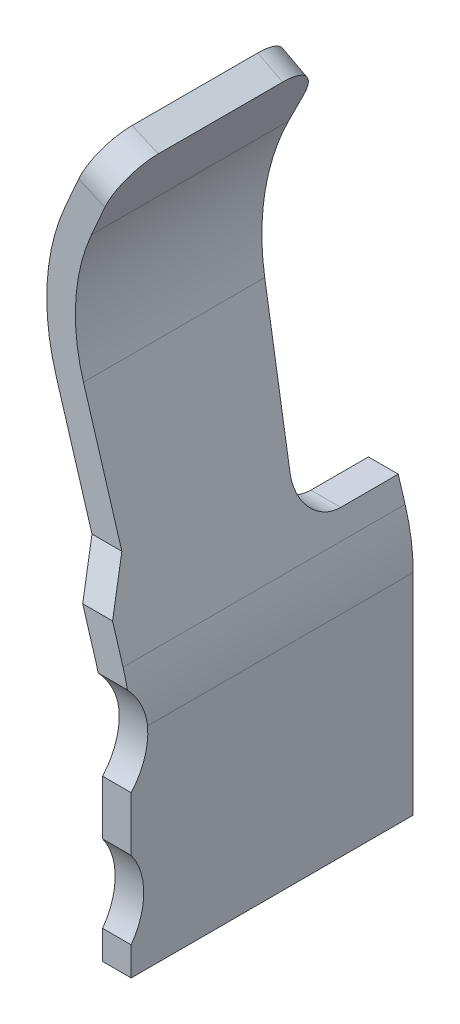
ISO-10303-21;
HEADER;
FILE_DESCRIPTION(('STEP AP214'),'2;1');
FILE_NAME('part.step','',(''),(''),'','','');
FILE_SCHEMA(('AUTOMOTIVE_DESIGN { 1 0 10303 214 1 1 1 1 }'));
ENDSEC;
DATA;
#1=APPLICATION_CONTEXT('core data for automotive mechanical design processes');
#2=APPLICATION_PROTOCOL_DEFINITION('international standard','automotive_design',2000,#1);
#3=PRODUCT_CONTEXT('',#1,'mechanical');
#4=PRODUCT('Part','Part','',(#3));
#5=PRODUCT_RELATED_PRODUCT_CATEGORY('part','',(#4));
#6=PRODUCT_DEFINITION_FORMATION('','',#4);
#7=PRODUCT_DEFINITION_CONTEXT('part definition',#1,'design');
#8=PRODUCT_DEFINITION('design','',#6,#7);
#9=PRODUCT_DEFINITION_SHAPE('','',#8);
#10=(LENGTH_UNIT() NAMED_UNIT(*) SI_UNIT(.MILLI.,.METRE.));
#11=(NAMED_UNIT(*) PLANE_ANGLE_UNIT() SI_UNIT($,.RADIAN.));
#12=(NAMED_UNIT(*) SI_UNIT($,.STERADIAN.) SOLID_ANGLE_UNIT());
#13=UNCERTAINTY_MEASURE_WITH_UNIT(LENGTH_MEASURE(1.E-05),#10,'distance_accuracy_value','');
#14=(GEOMETRIC_REPRESENTATION_CONTEXT(3) GLOBAL_UNCERTAINTY_ASSIGNED_CONTEXT((#13)) GLOBAL_UNIT_ASSIGNED_CONTEXT((#10,
#11,#12)) REPRESENTATION_CONTEXT('',''));
#15=CARTESIAN_POINT('',(0.,0.,0.));
#16=DIRECTION('',(0.,0.,1.));
#17=DIRECTION('',(1.,0.,0.));
#18=AXIS2_PLACEMENT_3D('',#15,#16,#17);
#19=CARTESIAN_POINT('',(-8.28155506681892,3.52330708865174,0.423604352914839));
#20=DIRECTION('',(0.915327071470026,-0.402711251685505,0.));
#21=DIRECTION('',(0.402711251685505,0.915327071470026,0.));
#22=AXIS2_PLACEMENT_3D('',#19,#20,#21);
#23=CYLINDRICAL_SURFACE('',#22,0.2);
#24=CARTESIAN_POINT('',(-8.28155506681892,3.52330708865174,0.423604352914839));
#25=DIRECTION('',(-0.915327071470029,0.402711251685498,0.));
#26=DIRECTION('',(0.402711251685498,0.915327071470029,0.));
#27=AXIS2_PLACEMENT_3D('',#24,#25,#26);
#28=CIRCLE('',#27,0.2);
#29=CARTESIAN_POINT('',(-8.28155506681892,3.52330708865174,0.623604352914839));
#30=VERTEX_POINT('',#29);
#31=CARTESIAN_POINT('',(-8.20101281648182,3.70637250294574,0.423604352914839));
#32=VERTEX_POINT('',#31);
#33=EDGE_CURVE('E295',#30,#32,#28,.T.);
#34=ORIENTED_EDGE('',*,*,#33,.F.);
#35=DIRECTION('',(-0.915327071470027,0.402711251685503,0.));
#36=VECTOR('',#35,1.);
#37=CARTESIAN_POINT('',(-32.8915059297134,14.3508073613119,0.623604352914805));
#38=LINE('',#37,#36);
#39=CARTESIAN_POINT('',(-8.14425600609842,3.46290040089891,0.623604352914839));
#40=VERTEX_POINT('',#39);
#41=EDGE_CURVE('E27',#40,#30,#38,.T.);
#42=ORIENTED_EDGE('',*,*,#41,.F.);
#43=CARTESIAN_POINT('',(-8.14425600609842,3.46290040089891,0.423604352914839));
#44=DIRECTION('',(0.915327071470029,-0.402711251685498,0.));
#45=DIRECTION('',(-0.402711251685498,-0.915327071470029,0.));
#46=AXIS2_PLACEMENT_3D('',#43,#44,#45);
#47=CIRCLE('',#46,0.2);
#48=CARTESIAN_POINT('',(-8.06371375576132,3.64596581519291,0.423604352914839));
#49=VERTEX_POINT('',#48);
#50=EDGE_CURVE('E314',#49,#40,#47,.T.);
#51=ORIENTED_EDGE('',*,*,#50,.F.);
#52=DIRECTION('',(0.915327071470027,-0.402711251685503,0.));
#53=VECTOR('',#52,1.);
#54=CARTESIAN_POINT('',(-8.20101281648182,3.70637250294574,0.423604352914839));
#55=LINE('',#54,#53);
#56=EDGE_CURVE('E304',#32,#49,#55,.T.);
#57=ORIENTED_EDGE('',*,*,#56,.F.);
#58=EDGE_LOOP('',(#34,#42,#51,#57));
#59=FACE_BOUND('',#58,.T.);
#60=ADVANCED_FACE('F16',(#59),#23,.T.);
#61=CARTESIAN_POINT('',(-8.30386274132999,3.53312166947706,-0.236832722369337));
#62=DIRECTION('',(-0.914255270392897,0.402239697454475,-0.0483789866630451));
#63=DIRECTION('',(-0.402711251685505,-0.915327071470026,0.));
#64=AXIS2_PLACEMENT_3D('',#61,#62,#63);
#65=CYLINDRICAL_SURFACE('',#64,0.2);
#66=CARTESIAN_POINT('',(-8.15305946195423,3.44289092405021,-0.427421697659668));
#67=CARTESIAN_POINT('',(-8.10198253480764,3.55898426375477,-0.441384710680955));
#68=CARTESIAN_POINT('',(-8.06371375576132,3.64596581519291,-0.356133634256614));
#69=CARTESIAN_POINT('',(-8.06371375576131,3.64596581519291,-0.228386927890316));
#70=(BOUNDED_CURVE() B_SPLINE_CURVE(3,(#66,#67,#68,#69),.UNSPECIFIED.,.F.,
.F.) B_SPLINE_CURVE_WITH_KNOTS((4,4),(6.17366415670651,7.85398163397443),
.UNSPECIFIED.) CURVE() GEOMETRIC_REPRESENTATION_ITEM() RATIONAL_B_SPLINE_CURVE((1.,
0.778229742533869,0.778229742533869,1.)) REPRESENTATION_ITEM(''));
#71=CARTESIAN_POINT('',(-8.15305946195423,3.44289092405021,-0.427421697659668));
#72=VERTEX_POINT('',#71);
#73=CARTESIAN_POINT('',(-8.06371375576131,3.64596581519291,-0.228386927890316));
#74=VERTEX_POINT('',#73);
#75=EDGE_CURVE('E309',#72,#74,#70,.T.);
#76=ORIENTED_EDGE('',*,*,#75,.F.);
#77=DIRECTION('',(0.914255270392898,-0.402239697454473,0.0483789866630451));
#78=VECTOR('',#77,1.);
#79=CARTESIAN_POINT('',(-33.491852655037,14.5910558161891,-1.76825633941021));
#80=LINE('',#79,#78);
#81=CARTESIAN_POINT('',(-8.29035852267473,3.50329761180303,-0.434687053017796));
#82=VERTEX_POINT('',#81);
#83=EDGE_CURVE('E11',#82,#72,#80,.T.);
#84=ORIENTED_EDGE('',*,*,#83,.F.);
#85=CARTESIAN_POINT('',(-8.20101281648182,3.70637250294574,-0.235652283248443));
#86=CARTESIAN_POINT('',(-8.20101281648182,3.70637250294574,-0.363398989614741));
#87=CARTESIAN_POINT('',(-8.23928159552813,3.61939095150759,-0.448650066039082));
#88=CARTESIAN_POINT('',(-8.29035852267473,3.50329761180303,-0.434687053017796));
#89=(BOUNDED_CURVE() B_SPLINE_CURVE(3,(#85,#86,#87,#88),.UNSPECIFIED.,.F.,
.F.) B_SPLINE_CURVE_WITH_KNOTS((4,4),(4.71238898038476,6.39270645765268),
.UNSPECIFIED.) CURVE() GEOMETRIC_REPRESENTATION_ITEM() RATIONAL_B_SPLINE_CURVE((1.,
0.778229742533871,0.778229742533871,1.)) REPRESENTATION_ITEM(''));
#90=CARTESIAN_POINT('',(-8.20101281648182,3.70637250294574,-0.235652283248443));
#91=VERTEX_POINT('',#90);
#92=EDGE_CURVE('E377',#91,#82,#89,.T.);
#93=ORIENTED_EDGE('',*,*,#92,.F.);
#94=DIRECTION('',(-0.914255270392898,0.402239697454473,-0.0483789866630451));
#95=VECTOR('',#94,1.);
#96=CARTESIAN_POINT('',(-8.22332049099289,3.71618708377106,-0.236832722369337));
#97=LINE('',#96,#95);
#98=EDGE_CURVE('E301',#74,#91,#97,.T.);
#99=ORIENTED_EDGE('',*,*,#98,.F.);
#100=EDGE_LOOP('',(#76,#84,#93,#99));
#101=FACE_BOUND('',#100,.T.);
#102=ADVANCED_FACE('F651',(#101),#65,.T.);
#103=CARTESIAN_POINT('',(-38.35,1.65634067151207,-0.212546111318104));
#104=DIRECTION('',(0.,-1.,0.));
#105=DIRECTION('',(0.,0.,-1.));
#106=AXIS2_PLACEMENT_3D('',#103,#104,#105);
#107=PLANE('',#106);
#108=DIRECTION('',(0.,0.,-1.));
#109=VECTOR('',#108,1.);
#110=CARTESIAN_POINT('',(-8.12516492105846,1.65634067151207,-0.740000000000018));
#111=LINE('',#110,#109);
#112=CARTESIAN_POINT('',(-8.12516492105846,1.65634067151207,-0.438042305987952));
#113=VERTEX_POINT('',#112);
#114=CARTESIAN_POINT('',(-8.12516492105846,1.65634067151207,-0.740000000000018));
#115=VERTEX_POINT('',#114);
#116=EDGE_CURVE('E321',#113,#115,#111,.T.);
#117=ORIENTED_EDGE('',*,*,#116,.F.);
#118=DIRECTION('',(1.,0.,0.));
#119=VECTOR('',#118,1.);
#120=CARTESIAN_POINT('',(-7.96849659089444,1.65634067151207,-0.438042305987951));
#121=LINE('',#120,#119);
#122=CARTESIAN_POINT('',(-7.96849659089442,1.65634067151207,-0.438042305987951));
#123=VERTEX_POINT('',#122);
#124=EDGE_CURVE('E272',#113,#123,#121,.T.);
#125=ORIENTED_EDGE('',*,*,#124,.T.);
#126=DIRECTION('',(0.,0.,1.));
#127=VECTOR('',#126,1.);
#128=CARTESIAN_POINT('',(-7.96849659089442,1.65634067151207,-0.740000000000018));
#129=LINE('',#128,#127);
#130=CARTESIAN_POINT('',(-7.96849659089442,1.65634067151207,-0.740000000000018));
#131=VERTEX_POINT('',#130);
#132=EDGE_CURVE('E334',#131,#123,#129,.T.);
#133=ORIENTED_EDGE('',*,*,#132,.F.);
#134=DIRECTION('',(-1.,0.,0.));
#135=VECTOR('',#134,1.);
#136=CARTESIAN_POINT('',(-8.89,1.65634067151207,-0.740000000000019));
#137=LINE('',#136,#135);
#138=EDGE_CURVE('E343',#131,#115,#137,.T.);
#139=ORIENTED_EDGE('',*,*,#138,.T.);
#140=EDGE_LOOP('',(#117,#125,#133,#139));
#141=FACE_BOUND('',#140,.T.);
#142=ADVANCED_FACE('F664',(#141),#107,.F.);
#143=CARTESIAN_POINT('',(-38.35,3.70637250294571,-0.459111687165995));
#144=DIRECTION('',(0.,0.119413416546905,0.992844618230162));
#145=DIRECTION('',(1.,0.,0.));
#146=AXIS2_PLACEMENT_3D('',#143,#144,#145);
#147=PLANE('',#146);
#148=DIRECTION('',(-0.28674853992682,0.951150986717314,-0.11439875574724));
#149=VECTOR('',#148,1.);
#150=CARTESIAN_POINT('',(-7.9503360451115,1.59610175610151,-0.205300934614502));
#151=LINE('',#150,#149);
#152=CARTESIAN_POINT('',(-8.03599169256638,1.88022335482146,-0.239473382341919));
#153=VERTEX_POINT('',#152);
#154=CARTESIAN_POINT('',(-8.25658626409634,2.61194022573825,-0.327479914176621));
#155=VERTEX_POINT('',#154);
#156=EDGE_CURVE('E336',#153,#155,#151,.T.);
#157=ORIENTED_EDGE('',*,*,#156,.F.);
#158=DIRECTION('',(-1.,0.,0.));
#159=VECTOR('',#158,1.);
#160=CARTESIAN_POINT('',(-8.12516492105847,1.88022335482146,-0.23947338234192));
#161=LINE('',#160,#159);
#162=CARTESIAN_POINT('',(-8.19266002273041,1.88022335482146,-0.23947338234192));
#163=VERTEX_POINT('',#162);
#164=EDGE_CURVE('E286',#153,#163,#161,.T.);
#165=ORIENTED_EDGE('',*,*,#164,.T.);
#166=DIRECTION('',(0.286748539926818,-0.951150986717315,0.11439875574724));
#167=VECTOR('',#166,1.);
#168=CARTESIAN_POINT('',(-8.09412236488806,1.55337185451571,-0.200161637444145));
#169=LINE('',#168,#167);
#170=CARTESIAN_POINT('',(-8.40020176045379,2.56864369924933,-0.322272466749579));
#171=VERTEX_POINT('',#170);
#172=EDGE_CURVE('E325',#171,#163,#169,.T.);
#173=ORIENTED_EDGE('',*,*,#172,.F.);
#174=CARTESIAN_POINT('',(-8.35177575390392,3.36370167510267,-0.417897288102545));
#175=CARTESIAN_POINT('',(-8.46330079490673,3.11021511680704,-0.387409439934768));
#176=CARTESIAN_POINT('',(-8.48013739459604,2.83379189253285,-0.354162906673266));
#177=CARTESIAN_POINT('',(-8.40020176045379,2.56864369924933,-0.322272466749579));
#178=(BOUNDED_CURVE() B_SPLINE_CURVE(3,(#174,#175,#176,#177),.UNSPECIFIED.,.F.,
.F.) B_SPLINE_CURVE_WITH_KNOTS((4,4),(4.29791199977039,5.00519872138853),
.UNSPECIFIED.) CURVE() GEOMETRIC_REPRESENTATION_ITEM() RATIONAL_B_SPLINE_CURVE((1.,
0.958744787021091,0.958744787021091,1.)) REPRESENTATION_ITEM(''));
#179=CARTESIAN_POINT('',(-8.35177575390392,3.36370167510267,-0.417897288102545));
#180=VERTEX_POINT('',#179);
#181=EDGE_CURVE('E373',#180,#171,#178,.T.);
#182=ORIENTED_EDGE('',*,*,#181,.F.);
#183=DIRECTION('',(-0.400292818236851,-0.909830186054405,0.109428936813832));
#184=VECTOR('',#183,1.);
#185=CARTESIAN_POINT('',(-8.33766648991178,3.39577078475993,-0.421754368938234));
#186=LINE('',#185,#184);
#187=EDGE_CURVE('E374',#82,#180,#186,.T.);
#188=ORIENTED_EDGE('',*,*,#187,.F.);
#189=ORIENTED_EDGE('',*,*,#83,.T.);
#190=DIRECTION('',(0.400292818236852,0.909830186054405,-0.109428936813832));
#191=VECTOR('',#190,1.);
#192=CARTESIAN_POINT('',(-8.20004918034407,3.33608744850051,-0.414576013974332));
#193=LINE('',#192,#191);
#194=CARTESIAN_POINT('',(-8.21447669318342,3.30329498734983,-0.410631932744417));
#195=VERTEX_POINT('',#194);
#196=EDGE_CURVE('E308',#195,#72,#193,.T.);
#197=ORIENTED_EDGE('',*,*,#196,.F.);
#198=CARTESIAN_POINT('',(-8.25658626409634,2.61194022573825,-0.327479914176621));
#199=CARTESIAN_POINT('',(-8.32609551117657,2.84250387207174,-0.355210731501565));
#200=CARTESIAN_POINT('',(-8.3114549897076,3.08287189317973,-0.384120760424611));
#201=CARTESIAN_POINT('',(-8.21447669318342,3.30329498734983,-0.410631932744417));
#202=(BOUNDED_CURVE() B_SPLINE_CURVE(3,(#198,#199,#200,#201),.UNSPECIFIED.,.F.,
.F.) B_SPLINE_CURVE_WITH_KNOTS((4,4),(1.27798658579106,1.98527330740919),
.UNSPECIFIED.) CURVE() GEOMETRIC_REPRESENTATION_ITEM() RATIONAL_B_SPLINE_CURVE((1.,
0.958744787021091,0.958744787021091,1.)) REPRESENTATION_ITEM(''));
#203=EDGE_CURVE('E348',#155,#195,#202,.T.);
#204=ORIENTED_EDGE('',*,*,#203,.F.);
#205=EDGE_LOOP('',(#157,#165,#173,#182,#188,#189,#197,#204));
#206=FACE_BOUND('',#205,.T.);
#207=ADVANCED_FACE('F653',(#206),#147,.F.);
#208=CARTESIAN_POINT('',(-38.35,1.94413292378283,0.623604352914797));
#209=DIRECTION('',(0.,0.,-1.));
#210=DIRECTION('',(0.,-1.,0.));
#211=AXIS2_PLACEMENT_3D('',#208,#209,#210);
#212=PLANE('',#211);
#213=DIRECTION('',(-0.402711251685501,-0.915327071470028,0.));
#214=VECTOR('',#213,1.);
#215=CARTESIAN_POINT('',(-8.21447669318342,3.30329498734984,0.623604352914839));
#216=LINE('',#215,#214);
#217=CARTESIAN_POINT('',(-8.21447669318342,3.30329498734984,0.623604352914839));
#218=VERTEX_POINT('',#217);
#219=EDGE_CURVE('E329',#40,#218,#216,.T.);
#220=ORIENTED_EDGE('',*,*,#219,.F.);
#221=ORIENTED_EDGE('',*,*,#41,.T.);
#222=DIRECTION('',(0.4027112516855,0.915327071470028,0.));
#223=VECTOR('',#222,1.);
#224=CARTESIAN_POINT('',(-8.35177575390392,3.36370167510267,0.623604352914839));
#225=LINE('',#224,#223);
#226=CARTESIAN_POINT('',(-8.35177575390392,3.36370167510267,0.623604352914839));
#227=VERTEX_POINT('',#226);
#228=EDGE_CURVE('E300',#227,#30,#225,.T.);
#229=ORIENTED_EDGE('',*,*,#228,.F.);
#230=CARTESIAN_POINT('',(-7.29914962171339,2.90058373566433,0.62360435291484));
#231=DIRECTION('',(0.,0.,-1.));
#232=DIRECTION('',(-1.,0.,0.));
#233=AXIS2_PLACEMENT_3D('',#230,#231,#232);
#234=CIRCLE('',#233,1.15);
#235=CARTESIAN_POINT('',(-8.40020176045379,2.56864369924933,0.623604352914839));
#236=VERTEX_POINT('',#235);
#237=EDGE_CURVE('E389',#236,#227,#234,.T.);
#238=ORIENTED_EDGE('',*,*,#237,.F.);
#239=DIRECTION('',(-0.288643509926088,0.957436642382956,0.));
#240=VECTOR('',#239,1.);
#241=CARTESIAN_POINT('',(-8.07617885397449,1.49385284836845,0.623604352914839));
#242=LINE('',#241,#240);
#243=CARTESIAN_POINT('',(-8.21192717993568,1.94413292378283,0.623604352914839));
#244=VERTEX_POINT('',#243);
#245=EDGE_CURVE('E280',#244,#236,#242,.T.);
#246=ORIENTED_EDGE('',*,*,#245,.F.);
#247=DIRECTION('',(1.,0.,0.));
#248=VECTOR('',#247,1.);
#249=CARTESIAN_POINT('',(-38.35,1.94413292378283,0.623604352914797));
#250=LINE('',#249,#248);
#251=CARTESIAN_POINT('',(-8.05525884977165,1.94413292378283,0.623604352914839));
#252=VERTEX_POINT('',#251);
#253=EDGE_CURVE('E340',#244,#252,#250,.T.);
#254=ORIENTED_EDGE('',*,*,#253,.T.);
#255=DIRECTION('',(0.28864350992609,-0.957436642382956,0.));
#256=VECTOR('',#255,1.);
#257=CARTESIAN_POINT('',(-7.93256335761705,1.53714937485737,0.623604352914839));
#258=LINE('',#257,#256);
#259=CARTESIAN_POINT('',(-8.25658626409634,2.61194022573825,0.623604352914839));
#260=VERTEX_POINT('',#259);
#261=EDGE_CURVE('E339',#260,#252,#258,.T.);
#262=ORIENTED_EDGE('',*,*,#261,.F.);
#263=CARTESIAN_POINT('',(-7.29914962171339,2.90058373566433,0.62360435291484));
#264=DIRECTION('',(0.,0.,1.));
#265=DIRECTION('',(-1.,0.,0.));
#266=AXIS2_PLACEMENT_3D('',#263,#264,#265);
#267=CIRCLE('',#266,1.);
#268=EDGE_CURVE('E335',#218,#260,#267,.T.);
#269=ORIENTED_EDGE('',*,*,#268,.F.);
#270=EDGE_LOOP('',(#220,#221,#229,#238,#246,#254,#262,#269));
#271=FACE_BOUND('',#270,.T.);
#272=ADVANCED_FACE('F474',(#271),#212,.F.);
#273=CARTESIAN_POINT('',(-38.35,1.7003498353216,0.749999999999972));
#274=DIRECTION('',(0.,-0.460287319631494,-0.887770005906065));
#275=DIRECTION('',(0.,-0.887770005906065,0.460287319631494));
#276=AXIS2_PLACEMENT_3D('',#273,#274,#275);
#277=PLANE('',#276);
#278=DIRECTION('',(-1.,0.,0.));
#279=VECTOR('',#278,1.);
#280=CARTESIAN_POINT('',(-8.89,1.7196371362757,0.739999999999981));
#281=LINE('',#280,#279);
#282=CARTESIAN_POINT('',(-7.98757891232074,1.7196371362757,0.739999999999982));
#283=VERTEX_POINT('',#282);
#284=CARTESIAN_POINT('',(-8.14424724248478,1.7196371362757,0.739999999999982));
#285=VERTEX_POINT('',#284);
#286=EDGE_CURVE('E565',#283,#285,#281,.T.);
#287=ORIENTED_EDGE('',*,*,#286,.F.);
#288=DIRECTION('',(0.258541028225372,-0.857586072334425,0.444637678635293));
#289=VECTOR('',#288,1.);
#290=CARTESIAN_POINT('',(-8.11357656169357,2.13757401070795,0.523309818502748));
#291=LINE('',#290,#289);
#292=EDGE_CURVE('E381',#252,#283,#291,.T.);
#293=ORIENTED_EDGE('',*,*,#292,.F.);
#294=ORIENTED_EDGE('',*,*,#253,.F.);
#295=DIRECTION('',(-0.258541028225371,0.857586072334425,-0.444637678635293));
#296=VECTOR('',#295,1.);
#297=CARTESIAN_POINT('',(-8.2597726380838,2.10283732290249,0.541319952677684));
#298=LINE('',#297,#296);
#299=EDGE_CURVE('E285',#285,#244,#298,.T.);
#300=ORIENTED_EDGE('',*,*,#299,.F.);
#301=EDGE_LOOP('',(#287,#293,#294,#300));
#302=FACE_BOUND('',#301,.T.);
#303=ADVANCED_FACE('F634',(#302),#277,.F.);
#304=CARTESIAN_POINT('',(-8.89,1.24850586493128,0.739999999999981));
#305=DIRECTION('',(0.,0.,-1.));
#306=DIRECTION('',(0.,-1.,0.));
#307=AXIS2_PLACEMENT_3D('',#304,#305,#306);
#308=PLANE('',#307);
#309=DIRECTION('',(0.,-1.,0.));
#310=VECTOR('',#309,1.);
#311=CARTESIAN_POINT('',(-7.89,0.145965815192914,0.739999999999982));
#312=LINE('',#311,#310);
#313=CARTESIAN_POINT('',(-7.89,0.296740599868486,0.739999999999982));
#314=VERTEX_POINT('',#313);
#315=CARTESIAN_POINT('',(-7.89,0.145965815192914,0.739999999999982));
#316=VERTEX_POINT('',#315);
#317=EDGE_CURVE('E264',#314,#316,#312,.T.);
#318=ORIENTED_EDGE('',*,*,#317,.F.);
#319=DIRECTION('',(-1.,0.,0.));
#320=VECTOR('',#319,1.);
#321=CARTESIAN_POINT('',(-38.35,0.296740599868486,0.73999999999994));
#322=LINE('',#321,#320);
#323=CARTESIAN_POINT('',(-8.04,0.296740599868486,0.739999999999982));
#324=VERTEX_POINT('',#323);
#325=EDGE_CURVE('E543',#314,#324,#322,.T.);
#326=ORIENTED_EDGE('',*,*,#325,.T.);
#327=DIRECTION('',(0.,1.,0.));
#328=VECTOR('',#327,1.);
#329=CARTESIAN_POINT('',(-8.04,0.145965815192914,0.739999999999982));
#330=LINE('',#329,#328);
#331=CARTESIAN_POINT('',(-8.04,0.145965815192914,0.739999999999982));
#332=VERTEX_POINT('',#331);
#333=EDGE_CURVE('E240',#332,#324,#330,.T.);
#334=ORIENTED_EDGE('',*,*,#333,.F.);
#335=DIRECTION('',(-1.,0.,0.));
#336=VECTOR('',#335,1.);
#337=CARTESIAN_POINT('',(-8.04,0.145965815192914,0.739999999999982));
#338=LINE('',#337,#336);
#339=EDGE_CURVE('E252',#316,#332,#338,.T.);
#340=ORIENTED_EDGE('',*,*,#339,.F.);
#341=EDGE_LOOP('',(#318,#326,#334,#340));
#342=FACE_BOUND('',#341,.T.);
#343=ADVANCED_FACE('F1007',(#342),#308,.F.);
#344=CARTESIAN_POINT('',(-8.89,1.24850586493128,-0.740000000000019));
#345=DIRECTION('',(0.,0.,-1.));
#346=DIRECTION('',(0.,-1.,0.));
#347=AXIS2_PLACEMENT_3D('',#344,#345,#346);
#348=PLANE('',#347);
#349=ORIENTED_EDGE('',*,*,#138,.F.);
#350=DIRECTION('',(0.28864350992609,-0.957436642382956,0.));
#351=VECTOR('',#350,1.);
#352=CARTESIAN_POINT('',(-7.93256335761704,1.53714937485737,-0.740000000000018));
#353=LINE('',#352,#351);
#354=CARTESIAN_POINT('',(-7.93256335761705,1.53714937485737,-0.740000000000018));
#355=VERTEX_POINT('',#354);
#356=EDGE_CURVE('E330',#131,#355,#353,.T.);
#357=ORIENTED_EDGE('',*,*,#356,.T.);
#358=CARTESIAN_POINT('',(-8.89,1.24850586493128,-0.740000000000019));
#359=DIRECTION('',(0.,0.,-1.));
#360=DIRECTION('',(-1.,0.,0.));
#361=AXIS2_PLACEMENT_3D('',#358,#359,#360);
#362=CIRCLE('',#361,1.);
#363=CARTESIAN_POINT('',(-7.89,1.24850586493128,-0.740000000000018));
#364=VERTEX_POINT('',#363);
#365=EDGE_CURVE('E527',#355,#364,#362,.T.);
#366=ORIENTED_EDGE('',*,*,#365,.T.);
#367=DIRECTION('',(0.,-1.,0.));
#368=VECTOR('',#367,1.);
#369=CARTESIAN_POINT('',(-7.89,0.145965815192914,-0.740000000000018));
#370=LINE('',#369,#368);
#371=CARTESIAN_POINT('',(-7.89,0.145965815192914,-0.740000000000018));
#372=VERTEX_POINT('',#371);
#373=EDGE_CURVE('E41',#364,#372,#370,.T.);
#374=ORIENTED_EDGE('',*,*,#373,.T.);
#375=DIRECTION('',(-1.,0.,0.));
#376=VECTOR('',#375,1.);
#377=CARTESIAN_POINT('',(-8.04,0.145965815192914,-0.740000000000018));
#378=LINE('',#377,#376);
#379=CARTESIAN_POINT('',(-8.04,0.145965815192914,-0.740000000000018));
#380=VERTEX_POINT('',#379);
#381=EDGE_CURVE('E243',#372,#380,#378,.T.);
#382=ORIENTED_EDGE('',*,*,#381,.T.);
#383=DIRECTION('',(0.,1.,0.));
#384=VECTOR('',#383,1.);
#385=CARTESIAN_POINT('',(-8.04,0.145965815192914,-0.740000000000018));
#386=LINE('',#385,#384);
#387=CARTESIAN_POINT('',(-8.04,1.24850586493128,-0.740000000000018));
#388=VERTEX_POINT('',#387);
#389=EDGE_CURVE('E229',#380,#388,#386,.T.);
#390=ORIENTED_EDGE('',*,*,#389,.T.);
#391=CARTESIAN_POINT('',(-8.89,1.24850586493128,-0.740000000000019));
#392=DIRECTION('',(0.,0.,1.));
#393=DIRECTION('',(-1.,0.,0.));
#394=AXIS2_PLACEMENT_3D('',#391,#392,#393);
#395=CIRCLE('',#394,0.85);
#396=CARTESIAN_POINT('',(-8.07617885397449,1.49385284836845,-0.740000000000018));
#397=VERTEX_POINT('',#396);
#398=EDGE_CURVE('E279',#388,#397,#395,.T.);
#399=ORIENTED_EDGE('',*,*,#398,.T.);
#400=DIRECTION('',(-0.288643509926088,0.957436642382956,0.));
#401=VECTOR('',#400,1.);
#402=CARTESIAN_POINT('',(-8.07617885397449,1.49385284836845,-0.740000000000018));
#403=LINE('',#402,#401);
#404=EDGE_CURVE('E294',#397,#115,#403,.T.);
#405=ORIENTED_EDGE('',*,*,#404,.T.);
#406=EDGE_LOOP('',(#349,#357,#366,#374,#382,#390,#399,#405));
#407=FACE_BOUND('',#406,.T.);
#408=ADVANCED_FACE('F244',(#407),#348,.T.);
#409=CARTESIAN_POINT('',(-7.89,0.145965815192914,-0.740000000000018));
#410=DIRECTION('',(-1.,0.,0.));
#411=DIRECTION('',(0.,0.,1.));
#412=AXIS2_PLACEMENT_3D('',#409,#410,#411);
#413=PLANE('',#412);
#414=DIRECTION('',(0.,0.,1.));
#415=VECTOR('',#414,1.);
#416=CARTESIAN_POINT('',(-7.89,1.24850586493128,-0.740000000000018));
#417=LINE('',#416,#415);
#418=CARTESIAN_POINT('',(-7.89,1.24850586493128,0.654029100989327));
#419=VERTEX_POINT('',#418);
#420=EDGE_CURVE('E398',#364,#419,#417,.T.);
#421=ORIENTED_EDGE('',*,*,#420,.T.);
#422=CARTESIAN_POINT('',(-7.89,1.21669179396546,0.995153761033099));
#423=DIRECTION('',(1.,0.,0.));
#424=DIRECTION('',(0.,0.,1.));
#425=AXIS2_PLACEMENT_3D('',#422,#423,#424);
#426=CIRCLE('',#425,0.342604974863759);
#427=CARTESIAN_POINT('',(-7.89,0.988055123608201,0.739999999999982));
#428=VERTEX_POINT('',#427);
#429=EDGE_CURVE('E368',#428,#419,#426,.T.);
#430=ORIENTED_EDGE('',*,*,#429,.F.);
#431=DIRECTION('',(0.,-1.,0.));
#432=VECTOR('',#431,1.);
#433=CARTESIAN_POINT('',(-7.89,0.145965815192914,0.739999999999982));
#434=LINE('',#433,#432);
#435=CARTESIAN_POINT('',(-7.89,0.703259400131467,0.739999999999982));
#436=VERTEX_POINT('',#435);
#437=EDGE_CURVE('E390',#428,#436,#434,.T.);
#438=ORIENTED_EDGE('',*,*,#437,.T.);
#439=CARTESIAN_POINT('',(-7.89,0.499999999999977,1.01942683457021));
#440=DIRECTION('',(1.,0.,0.));
#441=DIRECTION('',(0.,0.,1.));
#442=AXIS2_PLACEMENT_3D('',#439,#440,#441);
#443=CIRCLE('',#442,0.345533991988848);
#444=EDGE_CURVE('E559',#314,#436,#443,.T.);
#445=ORIENTED_EDGE('',*,*,#444,.F.);
#446=ORIENTED_EDGE('',*,*,#317,.T.);
#447=DIRECTION('',(0.,0.,1.));
#448=VECTOR('',#447,1.);
#449=CARTESIAN_POINT('',(-7.89,0.145965815192914,-0.740000000000018));
#450=LINE('',#449,#448);
#451=EDGE_CURVE('E248',#372,#316,#450,.T.);
#452=ORIENTED_EDGE('',*,*,#451,.F.);
#453=ORIENTED_EDGE('',*,*,#373,.F.);
#454=EDGE_LOOP('',(#421,#430,#438,#445,#446,#452,#453));
#455=FACE_BOUND('',#454,.T.);
#456=ADVANCED_FACE('F438',(#455),#413,.F.);
#457=CARTESIAN_POINT('',(-8.89,1.24850586493128,-0.740000000000019));
#458=DIRECTION('',(0.,0.,1.));
#459=DIRECTION('',(1.,0.,0.));
#460=AXIS2_PLACEMENT_3D('',#457,#458,#459);
#461=CYLINDRICAL_SURFACE('',#460,1.);
#462=CARTESIAN_POINT('',(-8.89,1.24850586493128,0.739999999999981));
#463=DIRECTION('',(0.,0.,-1.));
#464=DIRECTION('',(-1.,0.,0.));
#465=AXIS2_PLACEMENT_3D('',#462,#463,#464);
#466=CIRCLE('',#465,1.);
#467=CARTESIAN_POINT('',(-7.93256335761705,1.53714937485737,0.739999999999982));
#468=VERTEX_POINT('',#467);
#469=CARTESIAN_POINT('',(-7.90956088186528,1.44532846432271,0.739999999999982));
#470=VERTEX_POINT('',#469);
#471=EDGE_CURVE('E393',#468,#470,#466,.T.);
#472=ORIENTED_EDGE('',*,*,#471,.T.);
#473=CARTESIAN_POINT('',(-7.90956088186528,1.44532846432271,0.739999999999982));
#474=CARTESIAN_POINT('',(-7.90887868258316,1.44193024717419,0.736954698545516));
#475=CARTESIAN_POINT('',(-7.9082027814915,1.43847176034268,0.733975045899713));
#476=CARTESIAN_POINT('',(-7.90687144047402,1.43145643098167,0.728168909339949));
#477=CARTESIAN_POINT('',(-7.90621591068377,1.42790021102164,0.725341693611874));
#478=CARTESIAN_POINT('',(-7.90492831183027,1.42068928784956,0.719840380711192));
#479=CARTESIAN_POINT('',(-7.90429616172077,1.4170350195159,0.717165732805539));
#480=CARTESIAN_POINT('',(-7.90305842787342,1.40962817005619,0.711969336935339));
#481=CARTESIAN_POINT('',(-7.90245278447872,1.40587584366121,0.709447240161798));
#482=CARTESIAN_POINT('',(-7.90127122870314,1.39827302810706,0.704555749407337));
#483=CARTESIAN_POINT('',(-7.90069529111153,1.39442262647134,0.702186225501929));
#484=CARTESIAN_POINT('',(-7.89957638277402,1.38662388081506,0.697599649617342));
#485=CARTESIAN_POINT('',(-7.89903343418321,1.38267547342761,0.695382699975815));
#486=CARTESIAN_POINT('',(-7.89798380395005,1.37468096295901,0.69110105992819));
#487=CARTESIAN_POINT('',(-7.89747720426114,1.37063466501774,0.689036713287309));
#488=CARTESIAN_POINT('',(-7.89650364840602,1.36244473872738,0.685059955148913));
#489=CARTESIAN_POINT('',(-7.89603684560395,1.3583008060415,0.683148133100318));
#490=CARTESIAN_POINT('',(-7.89514614898274,1.3499144264909,0.679475891500462));
#491=CARTESIAN_POINT('',(-7.89472250492899,1.3456715635433,0.677716361222172));
#492=CARTESIAN_POINT('',(-7.89392647194207,1.33713872195227,0.674376033868785));
#493=CARTESIAN_POINT('',(-7.89355381064898,1.33284913740284,0.672794295796538));
#494=CARTESIAN_POINT('',(-7.89286136145209,1.32422362544503,0.669809238507263));
#495=CARTESIAN_POINT('',(-7.89254136585007,1.31988795555442,0.668405223722634));
#496=CARTESIAN_POINT('',(-7.89195585588989,1.31117101253269,0.665775382478372));
#497=CARTESIAN_POINT('',(-7.89169020857533,1.30678987892403,0.664549123358656));
#498=CARTESIAN_POINT('',(-7.89121500632155,1.29798278695419,0.662274523841787));
#499=CARTESIAN_POINT('',(-7.89100540203928,1.29355687160866,0.661226027233393));
#500=CARTESIAN_POINT('',(-7.89064388775924,1.28466100981392,0.659306657193421));
#501=CARTESIAN_POINT('',(-7.89049201945118,1.28019103392999,0.658435912321225));
#502=CARTESIAN_POINT('',(-7.89024760848128,1.2712078703344,0.656871822149796));
#503=CARTESIAN_POINT('',(-7.89015520429872,1.26669460642063,0.65617889318397));
#504=CARTESIAN_POINT('',(-7.89003124362393,1.25762568522585,0.654969909316693));
#505=CARTESIAN_POINT('',(-7.88999992587799,1.25306993125338,0.654454554866673));
#506=CARTESIAN_POINT('',(-7.89,1.24850586493128,0.654029100989326));
#507=B_SPLINE_CURVE_WITH_KNOTS('',3,(#473,#474,#475,#476,#477,#478,#479,#480,#481,#482,#483,
#484,#485,#486,#487,#488,#489,#490,#491,#492,#493,#494,#495,#496,#497,#498,#499,#500,#501,#502,
#503,#504,#505,#506),.UNSPECIFIED.,.F.,.F.,(4,2,2,2,2,2,2,2,2,2,2,2,2,2,2,2,4),(0.,
0.0138407212061409,0.0276076629969692,0.0413212735159894,0.0550022400252173,0.0686713979829167,
0.0823496367919243,0.0960578043228913,0.1098166123811,0.123650992269016,0.137408310969682,
0.151110002599511,0.164777762982779,0.178433449670275,0.192098978145429,0.205796216649483,
0.219546882133365),.UNSPECIFIED.);
#508=EDGE_CURVE('E457',#470,#419,#507,.T.);
#509=ORIENTED_EDGE('',*,*,#508,.T.);
#510=ORIENTED_EDGE('',*,*,#420,.F.);
#511=ORIENTED_EDGE('',*,*,#365,.F.);
#512=DIRECTION('',(0.,0.,1.));
#513=VECTOR('',#512,1.);
#514=CARTESIAN_POINT('',(-7.93256335761705,1.53714937485737,-0.740000000000018));
#515=LINE('',#514,#513);
#516=EDGE_CURVE('E384',#355,#468,#515,.T.);
#517=ORIENTED_EDGE('',*,*,#516,.T.);
#518=EDGE_LOOP('',(#472,#509,#510,#511,#517));
#519=FACE_BOUND('',#518,.T.);
#520=ADVANCED_FACE('F433',(#519),#461,.T.);
#521=CARTESIAN_POINT('',(-7.93256335761704,1.53714937485737,-0.740000000000018));
#522=DIRECTION('',(-0.957436642382956,-0.28864350992609,0.));
#523=DIRECTION('',(-0.28864350992609,0.957436642382956,0.));
#524=AXIS2_PLACEMENT_3D('',#521,#522,#523);
#525=PLANE('',#524);
#526=ORIENTED_EDGE('',*,*,#356,.F.);
#527=ORIENTED_EDGE('',*,*,#132,.T.);
#528=CARTESIAN_POINT('',(-7.96849659089442,1.65634067151207,-0.438042305987951));
#529=CARTESIAN_POINT('',(-7.96849659089443,1.65634067151208,-0.320885018462571));
#530=CARTESIAN_POINT('',(-7.99347162343649,1.73918338398669,-0.238042305987951));
#531=CARTESIAN_POINT('',(-8.02879165317817,1.85634067151208,-0.238042305987952));
#532=(BOUNDED_CURVE() B_SPLINE_CURVE(3,(#528,#529,#530,#531),.UNSPECIFIED.,.F.,
.F.) B_SPLINE_CURVE_WITH_KNOTS((4,4),(3.1415926535898,4.71238898038469),
.UNSPECIFIED.) CURVE() GEOMETRIC_REPRESENTATION_ITEM() RATIONAL_B_SPLINE_CURVE((1.,
0.804737854124365,0.804737854124365,1.)) REPRESENTATION_ITEM(''));
#533=CARTESIAN_POINT('',(-8.02879165317817,1.85634067151208,-0.238042305987952));
#534=VERTEX_POINT('',#533);
#535=EDGE_CURVE('E550',#123,#534,#532,.T.);
#536=ORIENTED_EDGE('',*,*,#535,.T.);
#537=CARTESIAN_POINT('',(-8.02879165317817,1.85634067151208,-0.238042305987952));
#538=CARTESIAN_POINT('',(-8.03119884441548,1.86432537588468,-0.238042305987952));
#539=CARTESIAN_POINT('',(-8.03360172570136,1.87229578405696,-0.23851990151267));
#540=CARTESIAN_POINT('',(-8.03599169256638,1.88022335482146,-0.239473382341919));
#541=(BOUNDED_CURVE() B_SPLINE_CURVE(3,(#537,#538,#539,#540),.UNSPECIFIED.,.F.,
.F.) B_SPLINE_CURVE_WITH_KNOTS((4,4),(4.71238898038469,4.83208803082147),
.UNSPECIFIED.) CURVE() GEOMETRIC_REPRESENTATION_ITEM() RATIONAL_B_SPLINE_CURVE((1.,
0.998806367803328,0.998806367803328,1.)) REPRESENTATION_ITEM(''));
#542=EDGE_CURVE('E544',#534,#153,#541,.T.);
#543=ORIENTED_EDGE('',*,*,#542,.T.);
#544=ORIENTED_EDGE('',*,*,#156,.T.);
#545=DIRECTION('',(0.,0.,1.));
#546=VECTOR('',#545,1.);
#547=CARTESIAN_POINT('',(-8.25658626409634,2.61194022573825,-0.740000000000018));
#548=LINE('',#547,#546);
#549=EDGE_CURVE('E344',#155,#260,#548,.T.);
#550=ORIENTED_EDGE('',*,*,#549,.T.);
#551=ORIENTED_EDGE('',*,*,#261,.T.);
#552=ORIENTED_EDGE('',*,*,#292,.T.);
#553=DIRECTION('',(0.28864350992609,-0.957436642382956,0.));
#554=VECTOR('',#553,1.);
#555=CARTESIAN_POINT('',(-7.93256335761705,1.53714937485737,0.739999999999982));
#556=LINE('',#555,#554);
#557=EDGE_CURVE('E558',#283,#468,#556,.T.);
#558=ORIENTED_EDGE('',*,*,#557,.T.);
#559=ORIENTED_EDGE('',*,*,#516,.F.);
#560=EDGE_LOOP('',(#526,#527,#536,#543,#544,#550,#551,#552,#558,#559));
#561=FACE_BOUND('',#560,.T.);
#562=ADVANCED_FACE('F437',(#561),#525,.F.);
#563=CARTESIAN_POINT('',(-7.29914962171339,2.90058373566433,-0.740000000000017));
#564=DIRECTION('',(0.,0.,1.));
#565=DIRECTION('',(1.,0.,0.));
#566=AXIS2_PLACEMENT_3D('',#563,#564,#565);
#567=CYLINDRICAL_SURFACE('',#566,1.);
#568=ORIENTED_EDGE('',*,*,#549,.F.);
#569=ORIENTED_EDGE('',*,*,#203,.T.);
#570=DIRECTION('',(0.,0.,1.));
#571=VECTOR('',#570,1.);
#572=CARTESIAN_POINT('',(-8.21447669318342,3.30329498734983,-0.740000000000018));
#573=LINE('',#572,#571);
#574=EDGE_CURVE('E349',#195,#218,#573,.T.);
#575=ORIENTED_EDGE('',*,*,#574,.T.);
#576=ORIENTED_EDGE('',*,*,#268,.T.);
#577=EDGE_LOOP('',(#568,#569,#575,#576));
#578=FACE_BOUND('',#577,.T.);
#579=ADVANCED_FACE('F422',(#578),#567,.F.);
#580=CARTESIAN_POINT('',(-8.21447669318342,3.30329498734984,-0.740000000000018));
#581=DIRECTION('',(-0.915327071470028,0.402711251685501,0.));
#582=DIRECTION('',(0.,0.,1.));
#583=AXIS2_PLACEMENT_3D('',#580,#581,#582);
#584=PLANE('',#583);
#585=ORIENTED_EDGE('',*,*,#196,.T.);
#586=ORIENTED_EDGE('',*,*,#75,.T.);
#587=DIRECTION('',(0.,0.,1.));
#588=VECTOR('',#587,1.);
#589=CARTESIAN_POINT('',(-8.06371375576131,3.64596581519291,-0.740000000000018));
#590=LINE('',#589,#588);
#591=EDGE_CURVE('E299',#74,#49,#590,.T.);
#592=ORIENTED_EDGE('',*,*,#591,.T.);
#593=ORIENTED_EDGE('',*,*,#50,.T.);
#594=ORIENTED_EDGE('',*,*,#219,.T.);
#595=ORIENTED_EDGE('',*,*,#574,.F.);
#596=EDGE_LOOP('',(#585,#586,#592,#593,#594,#595));
#597=FACE_BOUND('',#596,.T.);
#598=ADVANCED_FACE('F476',(#597),#584,.F.);
#599=CARTESIAN_POINT('',(-8.20101281648182,3.70637250294574,-0.740000000000018));
#600=DIRECTION('',(-0.402711251685503,-0.915327071470027,0.));
#601=DIRECTION('',(-0.915327071470027,0.402711251685503,0.));
#602=AXIS2_PLACEMENT_3D('',#599,#600,#601);
#603=PLANE('',#602);
#604=ORIENTED_EDGE('',*,*,#591,.F.);
#605=ORIENTED_EDGE('',*,*,#98,.T.);
#606=DIRECTION('',(0.,0.,1.));
#607=VECTOR('',#606,1.);
#608=CARTESIAN_POINT('',(-8.20101281648182,3.70637250294574,-0.740000000000018));
#609=LINE('',#608,#607);
#610=EDGE_CURVE('E385',#91,#32,#609,.T.);
#611=ORIENTED_EDGE('',*,*,#610,.T.);
#612=ORIENTED_EDGE('',*,*,#56,.T.);
#613=EDGE_LOOP('',(#604,#605,#611,#612));
#614=FACE_BOUND('',#613,.T.);
#615=ADVANCED_FACE('F428',(#614),#603,.F.);
#616=CARTESIAN_POINT('',(-8.35177575390392,3.36370167510267,-0.740000000000018));
#617=DIRECTION('',(0.915327071470028,-0.4027112516855,0.));
#618=DIRECTION('',(0.,0.,-1.));
#619=AXIS2_PLACEMENT_3D('',#616,#617,#618);
#620=PLANE('',#619);
#621=ORIENTED_EDGE('',*,*,#610,.F.);
#622=ORIENTED_EDGE('',*,*,#92,.T.);
#623=ORIENTED_EDGE('',*,*,#187,.T.);
#624=DIRECTION('',(0.,0.,1.));
#625=VECTOR('',#624,1.);
#626=CARTESIAN_POINT('',(-8.35177575390392,3.36370167510267,-0.740000000000018));
#627=LINE('',#626,#625);
#628=EDGE_CURVE('E369',#180,#227,#627,.T.);
#629=ORIENTED_EDGE('',*,*,#628,.T.);
#630=ORIENTED_EDGE('',*,*,#228,.T.);
#631=ORIENTED_EDGE('',*,*,#33,.T.);
#632=EDGE_LOOP('',(#621,#622,#623,#629,#630,#631));
#633=FACE_BOUND('',#632,.T.);
#634=ADVANCED_FACE('F424',(#633),#620,.F.);
#635=CARTESIAN_POINT('',(-7.29914962171339,2.90058373566433,-0.740000000000017));
#636=DIRECTION('',(0.,0.,1.));
#637=DIRECTION('',(1.,0.,0.));
#638=AXIS2_PLACEMENT_3D('',#635,#636,#637);
#639=CYLINDRICAL_SURFACE('',#638,1.15);
#640=ORIENTED_EDGE('',*,*,#628,.F.);
#641=ORIENTED_EDGE('',*,*,#181,.T.);
#642=DIRECTION('',(0.,0.,1.));
#643=VECTOR('',#642,1.);
#644=CARTESIAN_POINT('',(-8.40020176045379,2.56864369924933,-0.740000000000019));
#645=LINE('',#644,#643);
#646=EDGE_CURVE('E284',#171,#236,#645,.T.);
#647=ORIENTED_EDGE('',*,*,#646,.T.);
#648=ORIENTED_EDGE('',*,*,#237,.T.);
#649=EDGE_LOOP('',(#640,#641,#647,#648));
#650=FACE_BOUND('',#649,.T.);
#651=ADVANCED_FACE('F427',(#650),#639,.T.);
#652=CARTESIAN_POINT('',(-8.07617885397449,1.49385284836845,-0.740000000000018));
#653=DIRECTION('',(0.957436642382956,0.288643509926088,0.));
#654=DIRECTION('',(0.,0.,-1.));
#655=AXIS2_PLACEMENT_3D('',#652,#653,#654);
#656=PLANE('',#655);
#657=ORIENTED_EDGE('',*,*,#172,.T.);
#658=CARTESIAN_POINT('',(-8.19266002273041,1.88022335482146,-0.23947338234192));
#659=CARTESIAN_POINT('',(-8.19027005586539,1.87229578405696,-0.23851990151267));
#660=CARTESIAN_POINT('',(-8.18786717457951,1.86432537588468,-0.238042305987952));
#661=CARTESIAN_POINT('',(-8.1854599833422,1.85634067151208,-0.238042305987952));
#662=(BOUNDED_CURVE() B_SPLINE_CURVE(3,(#658,#659,#660,#661),.UNSPECIFIED.,.F.,
.F.) B_SPLINE_CURVE_WITH_KNOTS((4,4),(1.45109727635811,1.5707963267949),
.UNSPECIFIED.) CURVE() GEOMETRIC_REPRESENTATION_ITEM() RATIONAL_B_SPLINE_CURVE((1.,
0.998806367803328,0.998806367803328,1.)) REPRESENTATION_ITEM(''));
#663=CARTESIAN_POINT('',(-8.1854599833422,1.85634067151208,-0.238042305987952));
#664=VERTEX_POINT('',#663);
#665=EDGE_CURVE('E271',#163,#664,#662,.T.);
#666=ORIENTED_EDGE('',*,*,#665,.T.);
#667=CARTESIAN_POINT('',(-8.1854599833422,1.85634067151208,-0.238042305987952));
#668=CARTESIAN_POINT('',(-8.15013995360052,1.73918338398669,-0.238042305987952));
#669=CARTESIAN_POINT('',(-8.12516492105846,1.65634067151208,-0.320885018462571));
#670=CARTESIAN_POINT('',(-8.12516492105846,1.65634067151207,-0.438042305987952));
#671=(BOUNDED_CURVE() B_SPLINE_CURVE(3,(#667,#668,#669,#670),.UNSPECIFIED.,.F.,
.F.) B_SPLINE_CURVE_WITH_KNOTS((4,4),(1.5707963267949,3.1415926535898),
.UNSPECIFIED.) CURVE() GEOMETRIC_REPRESENTATION_ITEM() RATIONAL_B_SPLINE_CURVE((1.,
0.804737854124365,0.804737854124365,1.)) REPRESENTATION_ITEM(''));
#672=EDGE_CURVE('E266',#664,#113,#671,.T.);
#673=ORIENTED_EDGE('',*,*,#672,.T.);
#674=ORIENTED_EDGE('',*,*,#116,.T.);
#675=ORIENTED_EDGE('',*,*,#404,.F.);
#676=DIRECTION('',(0.,0.,1.));
#677=VECTOR('',#676,1.);
#678=CARTESIAN_POINT('',(-8.07617885397449,1.49385284836845,-0.740000000000018));
#679=LINE('',#678,#677);
#680=CARTESIAN_POINT('',(-8.07617885397449,1.49385284836845,0.739999999999982));
#681=VERTEX_POINT('',#680);
#682=EDGE_CURVE('E273',#397,#681,#679,.T.);
#683=ORIENTED_EDGE('',*,*,#682,.T.);
#684=DIRECTION('',(-0.288643509926088,0.957436642382956,0.));
#685=VECTOR('',#684,1.);
#686=CARTESIAN_POINT('',(-8.07617885397449,1.49385284836845,0.739999999999982));
#687=LINE('',#686,#685);
#688=EDGE_CURVE('E498',#681,#285,#687,.T.);
#689=ORIENTED_EDGE('',*,*,#688,.T.);
#690=ORIENTED_EDGE('',*,*,#299,.T.);
#691=ORIENTED_EDGE('',*,*,#245,.T.);
#692=ORIENTED_EDGE('',*,*,#646,.F.);
#693=EDGE_LOOP('',(#657,#666,#673,#674,#675,#683,#689,#690,#691,#692));
#694=FACE_BOUND('',#693,.T.);
#695=ADVANCED_FACE('F421',(#694),#656,.F.);
#696=CARTESIAN_POINT('',(-8.89,1.24850586493128,-0.740000000000019));
#697=DIRECTION('',(0.,0.,1.));
#698=DIRECTION('',(1.,0.,0.));
#699=AXIS2_PLACEMENT_3D('',#696,#697,#698);
#700=CYLINDRICAL_SURFACE('',#699,0.85);
#701=DIRECTION('',(0.,0.,1.));
#702=VECTOR('',#701,1.);
#703=CARTESIAN_POINT('',(-8.04,1.24850586493128,-0.740000000000018));
#704=LINE('',#703,#702);
#705=CARTESIAN_POINT('',(-8.04,1.24850586493128,0.654029100989327));
#706=VERTEX_POINT('',#705);
#707=EDGE_CURVE('E236',#388,#706,#704,.T.);
#708=ORIENTED_EDGE('',*,*,#707,.T.);
#709=CARTESIAN_POINT('',(-8.04,1.24850586493128,0.654029100989326));
#710=CARTESIAN_POINT('',(-8.03999991209808,1.25307172693062,0.654454720262645));
#711=CARTESIAN_POINT('',(-8.04003678605821,1.2576292439297,0.65497044121802));
#712=CARTESIAN_POINT('',(-8.04018276310792,1.26670316475237,0.656180580970943));
#713=CARTESIAN_POINT('',(-8.04029161428366,1.2712196564707,0.656874371378024));
#714=CARTESIAN_POINT('',(-8.0405795966021,1.28021043459153,0.658440607166872));
#715=CARTESIAN_POINT('',(-8.04075859333337,1.28468478505172,0.659312709351909));
#716=CARTESIAN_POINT('',(-8.04118479027863,1.29359026706904,0.66123521565365));
#717=CARTESIAN_POINT('',(-8.04143196922435,1.29802141165796,0.662285564130212));
#718=CARTESIAN_POINT('',(-8.04199249708052,1.30683955789749,0.664564290110276));
#719=CARTESIAN_POINT('',(-8.04230593089031,1.31122649527104,0.665792895393331));
#720=CARTESIAN_POINT('',(-8.04299693645541,1.3199553830377,0.668427852265554));
#721=CARTESIAN_POINT('',(-8.04337469034792,1.32429716745913,0.669834705627356));
#722=CARTESIAN_POINT('',(-8.04419232362275,1.33293499859274,0.67282587071001));
#723=CARTESIAN_POINT('',(-8.04463247178103,1.33723075608392,0.674410943694387));
#724=CARTESIAN_POINT('',(-8.04557288956928,1.34577581205573,0.677758358644028));
#725=CARTESIAN_POINT('',(-8.04607350264201,1.35002467970638,0.679521703002873));
#726=CARTESIAN_POINT('',(-8.04712469332697,1.35841002700116,0.68319649068392));
#727=CARTESIAN_POINT('',(-8.04767483337837,1.36254713822208,0.685106618702859));
#728=CARTESIAN_POINT('',(-8.04882244078361,1.37072413591773,0.689079813923092));
#729=CARTESIAN_POINT('',(-8.04941975265843,1.37476428891415,0.691142377362032));
#730=CARTESIAN_POINT('',(-8.0506576588271,1.38274714659941,0.695420264461907));
#731=CARTESIAN_POINT('',(-8.05129817809432,1.38669000475738,0.69763532345596));
#732=CARTESIAN_POINT('',(-8.0526185655259,1.39447822720174,0.702217943435946));
#733=CARTESIAN_POINT('',(-8.0532984257206,1.39832361100899,0.704585473545323));
#734=CARTESIAN_POINT('',(-8.05469366221943,1.40591692940895,0.709472808735537));
#735=CARTESIAN_POINT('',(-8.055409083347,1.40966473145083,0.71199280691319));
#736=CARTESIAN_POINT('',(-8.05687171890919,1.41706305442134,0.717184847198378));
#737=CARTESIAN_POINT('',(-8.05761901622157,1.42071327585296,0.719857292618815));
#738=CARTESIAN_POINT('',(-8.05914177726432,1.4279166306681,0.725354048734386));
#739=CARTESIAN_POINT('',(-8.05991734709402,1.43146928614048,0.728178955935315));
#740=CARTESIAN_POINT('',(-8.06149317809701,1.43847803402667,0.733980340906898));
#741=CARTESIAN_POINT('',(-8.06229355440362,1.44193346413612,0.73695758776966));
#742=CARTESIAN_POINT('',(-8.0631016601971,1.44532846432271,0.739999999999982));
#743=B_SPLINE_CURVE_WITH_KNOTS('',3,(#709,#710,#711,#712,#713,#714,#715,#716,#717,#718,#719,
#720,#721,#722,#723,#724,#725,#726,#727,#728,#729,#730,#731,#732,#733,#734,#735,#736,#737,#738,
#739,#740,#741,#742),.UNSPECIFIED.,.F.,.F.,(4,2,2,2,2,2,2,2,2,2,2,2,2,2,2,2,4),(0.,
0.0137560099805446,0.0274641281891669,0.0411461066327758,0.054823822033313,0.0685191715441862,
0.0822539679800523,0.0960498370490649,0.109928118966885,0.123693986122702,0.137416236292815,
0.151115243353961,0.164811484932944,0.178525451067871,0.192277552593117,0.206088031282382,
0.219976873694123),.UNSPECIFIED.);
#744=CARTESIAN_POINT('',(-8.0631016601971,1.44532846432271,0.739999999999982));
#745=VERTEX_POINT('',#744);
#746=EDGE_CURVE('E404',#706,#745,#743,.T.);
#747=ORIENTED_EDGE('',*,*,#746,.T.);
#748=CARTESIAN_POINT('',(-8.89,1.24850586493128,0.739999999999981));
#749=DIRECTION('',(0.,0.,1.));
#750=DIRECTION('',(-1.,0.,0.));
#751=AXIS2_PLACEMENT_3D('',#748,#749,#750);
#752=CIRCLE('',#751,0.85);
#753=EDGE_CURVE('E495',#745,#681,#752,.T.);
#754=ORIENTED_EDGE('',*,*,#753,.T.);
#755=ORIENTED_EDGE('',*,*,#682,.F.);
#756=ORIENTED_EDGE('',*,*,#398,.F.);
#757=EDGE_LOOP('',(#708,#747,#754,#755,#756));
#758=FACE_BOUND('',#757,.T.);
#759=ADVANCED_FACE('F411',(#758),#700,.F.);
#760=CARTESIAN_POINT('',(-8.04,0.145965815192914,-0.740000000000018));
#761=DIRECTION('',(1.,0.,0.));
#762=DIRECTION('',(0.,0.,1.));
#763=AXIS2_PLACEMENT_3D('',#760,#761,#762);
#764=PLANE('',#763);
#765=DIRECTION('',(0.,1.,0.));
#766=VECTOR('',#765,1.);
#767=CARTESIAN_POINT('',(-8.04,0.145965815192914,0.739999999999982));
#768=LINE('',#767,#766);
#769=CARTESIAN_POINT('',(-8.04,0.703259400131467,0.739999999999982));
#770=VERTEX_POINT('',#769);
#771=CARTESIAN_POINT('',(-8.04,0.988055123608201,0.739999999999982));
#772=VERTEX_POINT('',#771);
#773=EDGE_CURVE('E260',#770,#772,#768,.T.);
#774=ORIENTED_EDGE('',*,*,#773,.T.);
#775=CARTESIAN_POINT('',(-8.04,1.21669179396546,0.995153761033099));
#776=DIRECTION('',(1.,0.,0.));
#777=DIRECTION('',(0.,0.,-1.));
#778=AXIS2_PLACEMENT_3D('',#775,#776,#777);
#779=CIRCLE('',#778,0.342604974863759);
#780=EDGE_CURVE('E290',#772,#706,#779,.T.);
#781=ORIENTED_EDGE('',*,*,#780,.T.);
#782=ORIENTED_EDGE('',*,*,#707,.F.);
#783=ORIENTED_EDGE('',*,*,#389,.F.);
#784=DIRECTION('',(0.,0.,1.));
#785=VECTOR('',#784,1.);
#786=CARTESIAN_POINT('',(-8.04,0.145965815192914,-0.740000000000018));
#787=LINE('',#786,#785);
#788=EDGE_CURVE('E233',#380,#332,#787,.T.);
#789=ORIENTED_EDGE('',*,*,#788,.T.);
#790=ORIENTED_EDGE('',*,*,#333,.T.);
#791=CARTESIAN_POINT('',(-8.04,0.499999999999977,1.01942683457021));
#792=DIRECTION('',(1.,0.,0.));
#793=DIRECTION('',(0.,0.,-1.));
#794=AXIS2_PLACEMENT_3D('',#791,#792,#793);
#795=CIRCLE('',#794,0.345533991988848);
#796=EDGE_CURVE('E512',#324,#770,#795,.T.);
#797=ORIENTED_EDGE('',*,*,#796,.T.);
#798=EDGE_LOOP('',(#774,#781,#782,#783,#789,#790,#797));
#799=FACE_BOUND('',#798,.T.);
#800=ADVANCED_FACE('F231',(#799),#764,.F.);
#801=CARTESIAN_POINT('',(-8.04,0.145965815192914,-0.740000000000018));
#802=DIRECTION('',(0.,1.,0.));
#803=DIRECTION('',(1.,0.,0.));
#804=AXIS2_PLACEMENT_3D('',#801,#802,#803);
#805=PLANE('',#804);
#806=ORIENTED_EDGE('',*,*,#339,.T.);
#807=ORIENTED_EDGE('',*,*,#788,.F.);
#808=ORIENTED_EDGE('',*,*,#381,.F.);
#809=ORIENTED_EDGE('',*,*,#451,.T.);
#810=EDGE_LOOP('',(#806,#807,#808,#809));
#811=FACE_BOUND('',#810,.T.);
#812=ADVANCED_FACE('F250',(#811),#805,.F.);
#813=CARTESIAN_POINT('',(-8.89,1.24850586493128,0.739999999999981));
#814=DIRECTION('',(0.,0.,-1.));
#815=DIRECTION('',(0.,-1.,0.));
#816=AXIS2_PLACEMENT_3D('',#813,#814,#815);
#817=PLANE('',#816);
#818=ORIENTED_EDGE('',*,*,#437,.F.);
#819=DIRECTION('',(-1.,0.,0.));
#820=VECTOR('',#819,1.);
#821=CARTESIAN_POINT('',(-38.35,0.988055123608201,0.73999999999994));
#822=LINE('',#821,#820);
#823=EDGE_CURVE('E364',#428,#772,#822,.T.);
#824=ORIENTED_EDGE('',*,*,#823,.T.);
#825=ORIENTED_EDGE('',*,*,#773,.F.);
#826=DIRECTION('',(1.,0.,0.));
#827=VECTOR('',#826,1.);
#828=CARTESIAN_POINT('',(-38.35,0.703259400131467,0.73999999999994));
#829=LINE('',#828,#827);
#830=EDGE_CURVE('E551',#770,#436,#829,.T.);
#831=ORIENTED_EDGE('',*,*,#830,.T.);
#832=EDGE_LOOP('',(#818,#824,#825,#831));
#833=FACE_BOUND('',#832,.T.);
#834=ADVANCED_FACE('F432',(#833),#817,.F.);
#835=CARTESIAN_POINT('',(-8.89,1.24850586493128,0.739999999999981));
#836=DIRECTION('',(0.,0.,-1.));
#837=DIRECTION('',(0.,-1.,0.));
#838=AXIS2_PLACEMENT_3D('',#835,#836,#837);
#839=PLANE('',#838);
#840=ORIENTED_EDGE('',*,*,#557,.F.);
#841=ORIENTED_EDGE('',*,*,#286,.T.);
#842=ORIENTED_EDGE('',*,*,#688,.F.);
#843=ORIENTED_EDGE('',*,*,#753,.F.);
#844=DIRECTION('',(1.,0.,0.));
#845=VECTOR('',#844,1.);
#846=CARTESIAN_POINT('',(-38.35,1.44532846432271,0.73999999999994));
#847=LINE('',#846,#845);
#848=EDGE_CURVE('E501',#745,#470,#847,.T.);
#849=ORIENTED_EDGE('',*,*,#848,.T.);
#850=ORIENTED_EDGE('',*,*,#471,.F.);
#851=EDGE_LOOP('',(#840,#841,#842,#843,#849,#850));
#852=FACE_BOUND('',#851,.T.);
#853=ADVANCED_FACE('F666',(#852),#839,.F.);
#854=CARTESIAN_POINT('',(-38.35,0.499999999999977,1.01942683457016));
#855=DIRECTION('',(1.,0.,0.));
#856=DIRECTION('',(0.,0.,-1.));
#857=AXIS2_PLACEMENT_3D('',#854,#855,#856);
#858=CYLINDRICAL_SURFACE('',#857,0.345533991988848);
#859=ORIENTED_EDGE('',*,*,#796,.F.);
#860=ORIENTED_EDGE('',*,*,#325,.F.);
#861=ORIENTED_EDGE('',*,*,#444,.T.);
#862=ORIENTED_EDGE('',*,*,#830,.F.);
#863=EDGE_LOOP('',(#859,#860,#861,#862));
#864=FACE_BOUND('',#863,.T.);
#865=ADVANCED_FACE('F18',(#864),#858,.F.);
#866=CARTESIAN_POINT('',(-38.35,1.21669179396546,0.995153761033057));
#867=DIRECTION('',(1.,0.,0.));
#868=DIRECTION('',(0.,0.,-1.));
#869=AXIS2_PLACEMENT_3D('',#866,#867,#868);
#870=CYLINDRICAL_SURFACE('',#869,0.342604974863759);
#871=ORIENTED_EDGE('',*,*,#780,.F.);
#872=ORIENTED_EDGE('',*,*,#823,.F.);
#873=ORIENTED_EDGE('',*,*,#429,.T.);
#874=ORIENTED_EDGE('',*,*,#508,.F.);
#875=ORIENTED_EDGE('',*,*,#848,.F.);
#876=ORIENTED_EDGE('',*,*,#746,.F.);
#877=EDGE_LOOP('',(#871,#872,#873,#874,#875,#876));
#878=FACE_BOUND('',#877,.T.);
#879=ADVANCED_FACE('F463',(#878),#870,.F.);
#880=CARTESIAN_POINT('',(-38.35,1.85634067151208,-0.438042305987994));
#881=DIRECTION('',(-1.,0.,0.));
#882=DIRECTION('',(0.,0.,1.));
#883=AXIS2_PLACEMENT_3D('',#880,#881,#882);
#884=CYLINDRICAL_SURFACE('',#883,0.2);
#885=ORIENTED_EDGE('',*,*,#542,.F.);
#886=ORIENTED_EDGE('',*,*,#535,.F.);
#887=ORIENTED_EDGE('',*,*,#124,.F.);
#888=ORIENTED_EDGE('',*,*,#672,.F.);
#889=ORIENTED_EDGE('',*,*,#665,.F.);
#890=ORIENTED_EDGE('',*,*,#164,.F.);
#891=EDGE_LOOP('',(#885,#886,#887,#888,#889,#890));
#892=FACE_BOUND('',#891,.T.);
#893=ADVANCED_FACE('F473',(#892),#884,.F.);
#894=CLOSED_SHELL('',(#60,#102,#142,#207,#272,#303,#343,#408,#456,#520,#562,#579,#598,#615,#634,
#651,#695,#759,#800,#812,#834,#853,#865,#879,#893));
#895=MANIFOLD_SOLID_BREP('B1',#894);
#896=ADVANCED_BREP_SHAPE_REPRESENTATION('',(#18,#895),#14);
#897=SHAPE_DEFINITION_REPRESENTATION(#9,#896);
ENDSEC;
END-ISO-10303-21;
